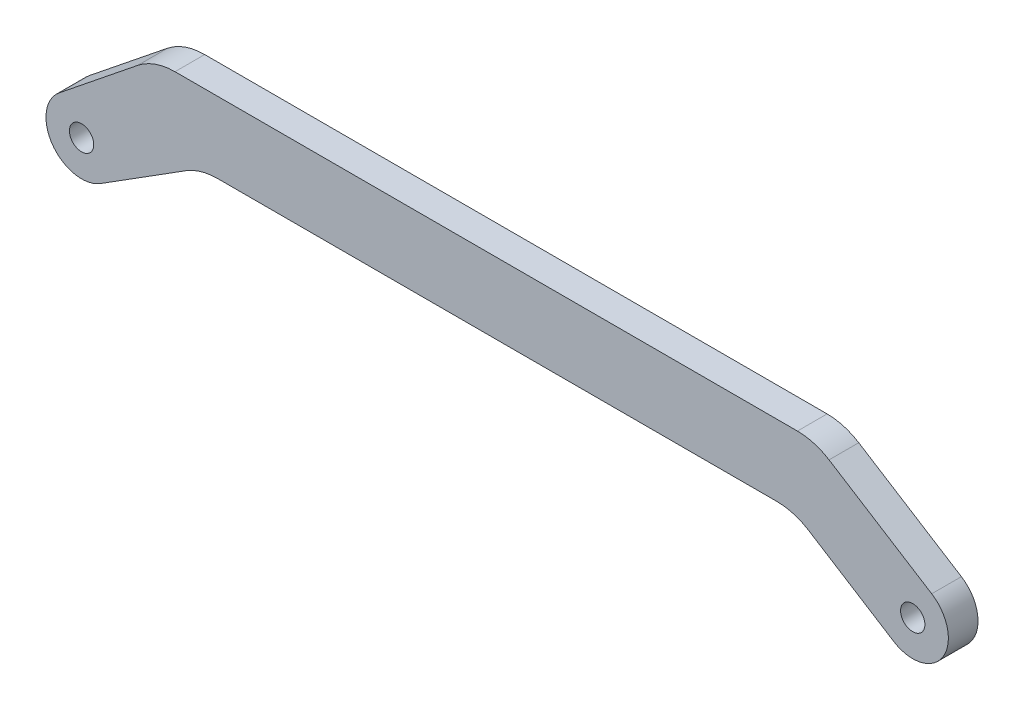
ISO-10303-21;
HEADER;
FILE_DESCRIPTION(('STEP AP214'),'2;1');
FILE_NAME('part.step','',(''),(''),'','','');
FILE_SCHEMA(('AUTOMOTIVE_DESIGN { 1 0 10303 214 1 1 1 1 }'));
ENDSEC;
DATA;
#1=APPLICATION_CONTEXT('core data for automotive mechanical design processes');
#2=APPLICATION_PROTOCOL_DEFINITION('international standard','automotive_design',2000,#1);
#3=PRODUCT_CONTEXT('',#1,'mechanical');
#4=PRODUCT('Part','Part','',(#3));
#5=PRODUCT_RELATED_PRODUCT_CATEGORY('part','',(#4));
#6=PRODUCT_DEFINITION_FORMATION('','',#4);
#7=PRODUCT_DEFINITION_CONTEXT('part definition',#1,'design');
#8=PRODUCT_DEFINITION('design','',#6,#7);
#9=PRODUCT_DEFINITION_SHAPE('','',#8);
#10=(LENGTH_UNIT() NAMED_UNIT(*) SI_UNIT(.MILLI.,.METRE.));
#11=(NAMED_UNIT(*) PLANE_ANGLE_UNIT() SI_UNIT($,.RADIAN.));
#12=(NAMED_UNIT(*) SI_UNIT($,.STERADIAN.) SOLID_ANGLE_UNIT());
#13=UNCERTAINTY_MEASURE_WITH_UNIT(LENGTH_MEASURE(1.E-05),#10,'distance_accuracy_value','');
#14=(GEOMETRIC_REPRESENTATION_CONTEXT(3) GLOBAL_UNCERTAINTY_ASSIGNED_CONTEXT((#13)) GLOBAL_UNIT_ASSIGNED_CONTEXT((#10,
#11,#12)) REPRESENTATION_CONTEXT('',''));
#15=CARTESIAN_POINT('',(0.,0.,0.));
#16=DIRECTION('',(0.,0.,1.));
#17=DIRECTION('',(1.,0.,0.));
#18=AXIS2_PLACEMENT_3D('',#15,#16,#17);
#19=CARTESIAN_POINT('',(15.7364952951131,7.50778352946216,5.));
#20=DIRECTION('',(0.,0.,-1.));
#21=DIRECTION('',(-1.,0.,0.));
#22=AXIS2_PLACEMENT_3D('',#19,#20,#21);
#23=CYLINDRICAL_SURFACE('',#22,10.);
#24=CARTESIAN_POINT('',(15.7364952951131,7.50778352946216,0.));
#25=DIRECTION('',(0.,0.,1.));
#26=DIRECTION('',(1.,0.,0.));
#27=AXIS2_PLACEMENT_3D('',#24,#25,#26);
#28=CIRCLE('',#27,10.);
#29=CARTESIAN_POINT('',(9.47479683384796,15.304650360452,0.));
#30=VERTEX_POINT('',#29);
#31=CARTESIAN_POINT('',(15.7364952951131,17.5077835294622,0.));
#32=VERTEX_POINT('',#31);
#33=EDGE_CURVE('E162',#30,#32,#28,.F.);
#34=ORIENTED_EDGE('',*,*,#33,.F.);
#35=DIRECTION('',(0.,0.,-1.));
#36=VECTOR('',#35,1.);
#37=CARTESIAN_POINT('',(9.47479683384796,15.304650360452,5.));
#38=LINE('',#37,#36);
#39=CARTESIAN_POINT('',(9.47479683384796,15.304650360452,5.));
#40=VERTEX_POINT('',#39);
#41=EDGE_CURVE('E11',#40,#30,#38,.T.);
#42=ORIENTED_EDGE('',*,*,#41,.F.);
#43=CARTESIAN_POINT('',(15.7364952951131,7.50778352946216,5.));
#44=DIRECTION('',(0.,0.,1.));
#45=DIRECTION('',(1.,0.,0.));
#46=AXIS2_PLACEMENT_3D('',#43,#44,#45);
#47=CIRCLE('',#46,10.);
#48=CARTESIAN_POINT('',(15.7364952951131,17.5077835294622,5.));
#49=VERTEX_POINT('',#48);
#50=EDGE_CURVE('E198',#40,#49,#47,.F.);
#51=ORIENTED_EDGE('',*,*,#50,.T.);
#52=DIRECTION('',(0.,0.,-1.));
#53=VECTOR('',#52,1.);
#54=CARTESIAN_POINT('',(15.7364952951131,17.5077835294622,5.));
#55=LINE('',#54,#53);
#56=EDGE_CURVE('E55',#49,#32,#55,.T.);
#57=ORIENTED_EDGE('',*,*,#56,.T.);
#58=EDGE_LOOP('',(#34,#42,#51,#57));
#59=FACE_BOUND('',#58,.T.);
#60=ADVANCED_FACE('F39',(#59),#23,.T.);
#61=CARTESIAN_POINT('',(-3.75701907675908,4.67812009859392,5.));
#62=DIRECTION('',(-0.626169846126513,0.779686683098986,0.));
#63=DIRECTION('',(-0.779686683098986,-0.626169846126513,0.));
#64=AXIS2_PLACEMENT_3D('',#61,#62,#63);
#65=PLANE('',#64);
#66=DIRECTION('',(0.779686683098986,0.626169846126513,0.));
#67=VECTOR('',#66,1.);
#68=CARTESIAN_POINT('',(-3.75701907675908,4.67812009859392,0.));
#69=LINE('',#68,#67);
#70=CARTESIAN_POINT('',(-3.75701907675908,4.67812009859392,0.));
#71=VERTEX_POINT('',#70);
#72=EDGE_CURVE('E164',#71,#30,#69,.T.);
#73=ORIENTED_EDGE('',*,*,#72,.F.);
#74=DIRECTION('',(0.,0.,-1.));
#75=VECTOR('',#74,1.);
#76=CARTESIAN_POINT('',(-3.75701907675908,4.67812009859392,5.));
#77=LINE('',#76,#75);
#78=CARTESIAN_POINT('',(-3.75701907675908,4.67812009859392,5.));
#79=VERTEX_POINT('',#78);
#80=EDGE_CURVE('E47',#79,#71,#77,.T.);
#81=ORIENTED_EDGE('',*,*,#80,.F.);
#82=DIRECTION('',(0.779686683098986,0.626169846126513,0.));
#83=VECTOR('',#82,1.);
#84=CARTESIAN_POINT('',(-3.75701907675908,4.67812009859392,5.));
#85=LINE('',#84,#83);
#86=EDGE_CURVE('E231',#79,#40,#85,.T.);
#87=ORIENTED_EDGE('',*,*,#86,.T.);
#88=ORIENTED_EDGE('',*,*,#41,.T.);
#89=EDGE_LOOP('',(#73,#81,#87,#88));
#90=FACE_BOUND('',#89,.T.);
#91=ADVANCED_FACE('F230',(#90),#65,.T.);
#92=CARTESIAN_POINT('',(0.,0.,5.));
#93=DIRECTION('',(0.,0.,-1.));
#94=DIRECTION('',(-1.,0.,0.));
#95=AXIS2_PLACEMENT_3D('',#92,#93,#94);
#96=CYLINDRICAL_SURFACE('',#95,6.);
#97=CARTESIAN_POINT('',(0.,0.,0.));
#98=DIRECTION('',(0.,0.,1.));
#99=DIRECTION('',(1.,0.,0.));
#100=AXIS2_PLACEMENT_3D('',#97,#98,#99);
#101=CIRCLE('',#100,6.);
#102=CARTESIAN_POINT('',(3.19805613686114,-5.07665607910215,0.));
#103=VERTEX_POINT('',#102);
#104=EDGE_CURVE('E167',#71,#103,#101,.T.);
#105=ORIENTED_EDGE('',*,*,#104,.T.);
#106=DIRECTION('',(0.,0.,-1.));
#107=VECTOR('',#106,1.);
#108=CARTESIAN_POINT('',(3.19805613686114,-5.07665607910215,5.));
#109=LINE('',#108,#107);
#110=CARTESIAN_POINT('',(3.19805613686114,-5.07665607910215,5.));
#111=VERTEX_POINT('',#110);
#112=EDGE_CURVE('E214',#111,#103,#109,.T.);
#113=ORIENTED_EDGE('',*,*,#112,.F.);
#114=CARTESIAN_POINT('',(0.,0.,5.));
#115=DIRECTION('',(0.,0.,1.));
#116=DIRECTION('',(1.,0.,0.));
#117=AXIS2_PLACEMENT_3D('',#114,#115,#116);
#118=CIRCLE('',#117,6.);
#119=EDGE_CURVE('E220',#79,#111,#118,.T.);
#120=ORIENTED_EDGE('',*,*,#119,.F.);
#121=ORIENTED_EDGE('',*,*,#80,.T.);
#122=EDGE_LOOP('',(#105,#113,#120,#121));
#123=FACE_BOUND('',#122,.T.);
#124=ADVANCED_FACE('F218',(#123),#96,.T.);
#125=CARTESIAN_POINT('',(3.19805613686114,-5.07665607910215,5.));
#126=DIRECTION('',(0.533009356143523,-0.846109346517025,0.));
#127=DIRECTION('',(0.846109346517025,0.533009356143523,0.));
#128=AXIS2_PLACEMENT_3D('',#125,#126,#127);
#129=PLANE('',#128);
#130=DIRECTION('',(-0.846109346517025,-0.533009356143523,0.));
#131=VECTOR('',#130,1.);
#132=CARTESIAN_POINT('',(3.19805613686114,-5.07665607910215,0.));
#133=LINE('',#132,#131);
#134=CARTESIAN_POINT('',(17.5571100440778,3.96887699463241,0.));
#135=VERTEX_POINT('',#134);
#136=EDGE_CURVE('E170',#135,#103,#133,.T.);
#137=ORIENTED_EDGE('',*,*,#136,.F.);
#138=DIRECTION('',(0.,0.,-1.));
#139=VECTOR('',#138,1.);
#140=CARTESIAN_POINT('',(17.5571100440778,3.96887699463241,5.));
#141=LINE('',#140,#139);
#142=CARTESIAN_POINT('',(17.5571100440778,3.96887699463241,5.));
#143=VERTEX_POINT('',#142);
#144=EDGE_CURVE('E212',#143,#135,#141,.T.);
#145=ORIENTED_EDGE('',*,*,#144,.F.);
#146=DIRECTION('',(-0.846109346517025,-0.533009356143523,0.));
#147=VECTOR('',#146,1.);
#148=CARTESIAN_POINT('',(3.19805613686114,-5.07665607910215,5.));
#149=LINE('',#148,#147);
#150=EDGE_CURVE('E422',#143,#111,#149,.T.);
#151=ORIENTED_EDGE('',*,*,#150,.T.);
#152=ORIENTED_EDGE('',*,*,#112,.T.);
#153=EDGE_LOOP('',(#137,#145,#151,#152));
#154=FACE_BOUND('',#153,.T.);
#155=ADVANCED_FACE('F253',(#154),#129,.T.);
#156=CARTESIAN_POINT('',(22.887203605513,-4.49221647053784,5.));
#157=DIRECTION('',(0.,0.,-1.));
#158=DIRECTION('',(-1.,0.,0.));
#159=AXIS2_PLACEMENT_3D('',#156,#157,#158);
#160=CYLINDRICAL_SURFACE('',#159,10.);
#161=CARTESIAN_POINT('',(22.887203605513,-4.49221647053784,0.));
#162=DIRECTION('',(0.,0.,1.));
#163=DIRECTION('',(1.,0.,0.));
#164=AXIS2_PLACEMENT_3D('',#161,#162,#163);
#165=CIRCLE('',#164,10.);
#166=CARTESIAN_POINT('',(22.887203605513,5.50778352946216,0.));
#167=VERTEX_POINT('',#166);
#168=EDGE_CURVE('E173',#135,#167,#165,.F.);
#169=ORIENTED_EDGE('',*,*,#168,.T.);
#170=DIRECTION('',(0.,0.,-1.));
#171=VECTOR('',#170,1.);
#172=CARTESIAN_POINT('',(22.887203605513,5.50778352946216,5.));
#173=LINE('',#172,#171);
#174=CARTESIAN_POINT('',(22.887203605513,5.50778352946216,5.));
#175=VERTEX_POINT('',#174);
#176=EDGE_CURVE('E209',#175,#167,#173,.T.);
#177=ORIENTED_EDGE('',*,*,#176,.F.);
#178=CARTESIAN_POINT('',(22.887203605513,-4.49221647053784,5.));
#179=DIRECTION('',(0.,0.,1.));
#180=DIRECTION('',(1.,0.,0.));
#181=AXIS2_PLACEMENT_3D('',#178,#179,#180);
#182=CIRCLE('',#181,10.);
#183=EDGE_CURVE('E423',#143,#175,#182,.F.);
#184=ORIENTED_EDGE('',*,*,#183,.F.);
#185=ORIENTED_EDGE('',*,*,#144,.T.);
#186=EDGE_LOOP('',(#169,#177,#184,#185));
#187=FACE_BOUND('',#186,.T.);
#188=ADVANCED_FACE('F258',(#187),#160,.F.);
#189=CARTESIAN_POINT('',(0.,5.50778352946216,5.));
#190=DIRECTION('',(0.,1.,0.));
#191=DIRECTION('',(-1.,0.,0.));
#192=AXIS2_PLACEMENT_3D('',#189,#190,#191);
#193=PLANE('',#192);
#194=DIRECTION('',(1.,0.,0.));
#195=VECTOR('',#194,1.);
#196=CARTESIAN_POINT('',(0.,5.50778352946216,0.));
#197=LINE('',#196,#195);
#198=CARTESIAN_POINT('',(117.112796394487,5.50778352946216,0.));
#199=VERTEX_POINT('',#198);
#200=EDGE_CURVE('E175',#167,#199,#197,.T.);
#201=ORIENTED_EDGE('',*,*,#200,.T.);
#202=DIRECTION('',(0.,0.,-1.));
#203=VECTOR('',#202,1.);
#204=CARTESIAN_POINT('',(117.112796394487,5.50778352946216,5.));
#205=LINE('',#204,#203);
#206=CARTESIAN_POINT('',(117.112796394487,5.50778352946216,5.));
#207=VERTEX_POINT('',#206);
#208=EDGE_CURVE('E207',#207,#199,#205,.T.);
#209=ORIENTED_EDGE('',*,*,#208,.F.);
#210=DIRECTION('',(1.,0.,0.));
#211=VECTOR('',#210,1.);
#212=CARTESIAN_POINT('',(0.,5.50778352946216,5.));
#213=LINE('',#212,#211);
#214=EDGE_CURVE('E425',#175,#207,#213,.T.);
#215=ORIENTED_EDGE('',*,*,#214,.F.);
#216=ORIENTED_EDGE('',*,*,#176,.T.);
#217=EDGE_LOOP('',(#201,#209,#215,#216));
#218=FACE_BOUND('',#217,.T.);
#219=ADVANCED_FACE('F262',(#218),#193,.F.);
#220=CARTESIAN_POINT('',(117.112796394487,-4.49221647053784,5.));
#221=DIRECTION('',(0.,0.,-1.));
#222=DIRECTION('',(-1.,0.,0.));
#223=AXIS2_PLACEMENT_3D('',#220,#221,#222);
#224=CYLINDRICAL_SURFACE('',#223,10.);
#225=CARTESIAN_POINT('',(117.112796394487,-4.49221647053784,0.));
#226=DIRECTION('',(0.,0.,1.));
#227=DIRECTION('',(1.,0.,0.));
#228=AXIS2_PLACEMENT_3D('',#225,#226,#227);
#229=CIRCLE('',#228,10.);
#230=CARTESIAN_POINT('',(122.442889955922,3.96887699463241,0.));
#231=VERTEX_POINT('',#230);
#232=EDGE_CURVE('E178',#231,#199,#229,.T.);
#233=ORIENTED_EDGE('',*,*,#232,.F.);
#234=DIRECTION('',(0.,0.,-1.));
#235=VECTOR('',#234,1.);
#236=CARTESIAN_POINT('',(122.442889955922,3.96887699463241,5.));
#237=LINE('',#236,#235);
#238=CARTESIAN_POINT('',(122.442889955922,3.96887699463241,5.));
#239=VERTEX_POINT('',#238);
#240=EDGE_CURVE('E205',#239,#231,#237,.T.);
#241=ORIENTED_EDGE('',*,*,#240,.F.);
#242=CARTESIAN_POINT('',(117.112796394487,-4.49221647053784,5.));
#243=DIRECTION('',(0.,0.,1.));
#244=DIRECTION('',(1.,0.,0.));
#245=AXIS2_PLACEMENT_3D('',#242,#243,#244);
#246=CIRCLE('',#245,10.);
#247=EDGE_CURVE('E416',#239,#207,#246,.T.);
#248=ORIENTED_EDGE('',*,*,#247,.T.);
#249=ORIENTED_EDGE('',*,*,#208,.T.);
#250=EDGE_LOOP('',(#233,#241,#248,#249));
#251=FACE_BOUND('',#250,.T.);
#252=ADVANCED_FACE('F266',(#251),#224,.F.);
#253=CARTESIAN_POINT('',(36.5758001862535,58.0611316428658,5.));
#254=DIRECTION('',(0.533009356143523,0.846109346517025,0.));
#255=DIRECTION('',(-0.846109346517025,0.533009356143524,0.));
#256=AXIS2_PLACEMENT_3D('',#253,#254,#255);
#257=PLANE('',#256);
#258=DIRECTION('',(0.846109346517025,-0.533009356143524,0.));
#259=VECTOR('',#258,1.);
#260=CARTESIAN_POINT('',(36.5758001862535,58.0611316428658,0.));
#261=LINE('',#260,#259);
#262=CARTESIAN_POINT('',(136.801943863139,-5.07665607910217,0.));
#263=VERTEX_POINT('',#262);
#264=EDGE_CURVE('E181',#231,#263,#261,.T.);
#265=ORIENTED_EDGE('',*,*,#264,.T.);
#266=DIRECTION('',(0.,0.,-1.));
#267=VECTOR('',#266,1.);
#268=CARTESIAN_POINT('',(136.801943863139,-5.07665607910217,5.));
#269=LINE('',#268,#267);
#270=CARTESIAN_POINT('',(136.801943863139,-5.07665607910217,5.));
#271=VERTEX_POINT('',#270);
#272=EDGE_CURVE('E202',#271,#263,#269,.T.);
#273=ORIENTED_EDGE('',*,*,#272,.F.);
#274=DIRECTION('',(0.846109346517025,-0.533009356143524,0.));
#275=VECTOR('',#274,1.);
#276=CARTESIAN_POINT('',(36.5758001862535,58.0611316428658,5.));
#277=LINE('',#276,#275);
#278=EDGE_CURVE('E432',#239,#271,#277,.T.);
#279=ORIENTED_EDGE('',*,*,#278,.F.);
#280=ORIENTED_EDGE('',*,*,#240,.T.);
#281=EDGE_LOOP('',(#265,#273,#279,#280));
#282=FACE_BOUND('',#281,.T.);
#283=ADVANCED_FACE('F270',(#282),#257,.F.);
#284=CARTESIAN_POINT('',(140.,0.,5.));
#285=DIRECTION('',(0.,0.,-1.));
#286=DIRECTION('',(-1.,0.,0.));
#287=AXIS2_PLACEMENT_3D('',#284,#285,#286);
#288=CYLINDRICAL_SURFACE('',#287,6.);
#289=CARTESIAN_POINT('',(140.,0.,0.));
#290=DIRECTION('',(0.,0.,1.));
#291=DIRECTION('',(1.,0.,0.));
#292=AXIS2_PLACEMENT_3D('',#289,#290,#291);
#293=CIRCLE('',#292,6.);
#294=CARTESIAN_POINT('',(143.198056136861,5.07665607910213,0.));
#295=VERTEX_POINT('',#294);
#296=EDGE_CURVE('E183',#263,#295,#293,.T.);
#297=ORIENTED_EDGE('',*,*,#296,.T.);
#298=DIRECTION('',(0.,0.,-1.));
#299=VECTOR('',#298,1.);
#300=CARTESIAN_POINT('',(143.198056136861,5.07665607910213,5.));
#301=LINE('',#300,#299);
#302=CARTESIAN_POINT('',(143.198056136861,5.07665607910213,5.));
#303=VERTEX_POINT('',#302);
#304=EDGE_CURVE('E138',#303,#295,#301,.T.);
#305=ORIENTED_EDGE('',*,*,#304,.F.);
#306=CARTESIAN_POINT('',(140.,0.,5.));
#307=DIRECTION('',(0.,0.,1.));
#308=DIRECTION('',(1.,0.,0.));
#309=AXIS2_PLACEMENT_3D('',#306,#307,#308);
#310=CIRCLE('',#309,6.);
#311=EDGE_CURVE('E147',#271,#303,#310,.T.);
#312=ORIENTED_EDGE('',*,*,#311,.F.);
#313=ORIENTED_EDGE('',*,*,#272,.T.);
#314=EDGE_LOOP('',(#297,#305,#312,#313));
#315=FACE_BOUND('',#314,.T.);
#316=ADVANCED_FACE('F274',(#315),#288,.T.);
#317=CARTESIAN_POINT('',(42.9719124599757,68.21444380107,5.));
#318=DIRECTION('',(0.533009356143523,0.846109346517025,0.));
#319=DIRECTION('',(-0.846109346517025,0.533009356143523,0.));
#320=AXIS2_PLACEMENT_3D('',#317,#318,#319);
#321=PLANE('',#320);
#322=DIRECTION('',(0.846109346517025,-0.533009356143523,0.));
#323=VECTOR('',#322,1.);
#324=CARTESIAN_POINT('',(42.9719124599757,68.21444380107,0.));
#325=LINE('',#324,#323);
#326=CARTESIAN_POINT('',(125.907534282538,15.9688769946324,0.));
#327=VERTEX_POINT('',#326);
#328=EDGE_CURVE('E134',#327,#295,#325,.T.);
#329=ORIENTED_EDGE('',*,*,#328,.F.);
#330=DIRECTION('',(0.,0.,-1.));
#331=VECTOR('',#330,1.);
#332=CARTESIAN_POINT('',(125.907534282538,15.9688769946324,5.));
#333=LINE('',#332,#331);
#334=CARTESIAN_POINT('',(125.907534282538,15.9688769946324,5.));
#335=VERTEX_POINT('',#334);
#336=EDGE_CURVE('E129',#335,#327,#333,.T.);
#337=ORIENTED_EDGE('',*,*,#336,.F.);
#338=DIRECTION('',(0.846109346517025,-0.533009356143523,0.));
#339=VECTOR('',#338,1.);
#340=CARTESIAN_POINT('',(42.9719124599757,68.21444380107,5.));
#341=LINE('',#340,#339);
#342=EDGE_CURVE('E132',#335,#303,#341,.T.);
#343=ORIENTED_EDGE('',*,*,#342,.T.);
#344=ORIENTED_EDGE('',*,*,#304,.T.);
#345=EDGE_LOOP('',(#329,#337,#343,#344));
#346=FACE_BOUND('',#345,.T.);
#347=ADVANCED_FACE('F131',(#346),#321,.T.);
#348=CARTESIAN_POINT('',(120.577440721103,7.50778352946216,5.));
#349=DIRECTION('',(0.,0.,-1.));
#350=DIRECTION('',(-1.,0.,0.));
#351=AXIS2_PLACEMENT_3D('',#348,#349,#350);
#352=CYLINDRICAL_SURFACE('',#351,9.99999999999999);
#353=CARTESIAN_POINT('',(120.577440721103,7.50778352946216,0.));
#354=DIRECTION('',(0.,0.,1.));
#355=DIRECTION('',(1.,0.,0.));
#356=AXIS2_PLACEMENT_3D('',#353,#354,#355);
#357=CIRCLE('',#356,9.99999999999999);
#358=CARTESIAN_POINT('',(120.577440721103,17.5077835294622,0.));
#359=VERTEX_POINT('',#358);
#360=EDGE_CURVE('E187',#359,#327,#357,.F.);
#361=ORIENTED_EDGE('',*,*,#360,.F.);
#362=DIRECTION('',(0.,0.,-1.));
#363=VECTOR('',#362,1.);
#364=CARTESIAN_POINT('',(120.577440721103,17.5077835294622,5.));
#365=LINE('',#364,#363);
#366=CARTESIAN_POINT('',(120.577440721103,17.5077835294622,5.));
#367=VERTEX_POINT('',#366);
#368=EDGE_CURVE('E92',#367,#359,#365,.T.);
#369=ORIENTED_EDGE('',*,*,#368,.F.);
#370=CARTESIAN_POINT('',(120.577440721103,7.50778352946216,5.));
#371=DIRECTION('',(0.,0.,1.));
#372=DIRECTION('',(1.,0.,0.));
#373=AXIS2_PLACEMENT_3D('',#370,#371,#372);
#374=CIRCLE('',#373,9.99999999999999);
#375=EDGE_CURVE('E145',#367,#335,#374,.F.);
#376=ORIENTED_EDGE('',*,*,#375,.T.);
#377=ORIENTED_EDGE('',*,*,#336,.T.);
#378=EDGE_LOOP('',(#361,#369,#376,#377));
#379=FACE_BOUND('',#378,.T.);
#380=ADVANCED_FACE('F150',(#379),#352,.T.);
#381=CARTESIAN_POINT('',(140.,0.,5.));
#382=DIRECTION('',(0.,0.,-1.));
#383=DIRECTION('',(-1.,0.,0.));
#384=AXIS2_PLACEMENT_3D('',#381,#382,#383);
#385=CYLINDRICAL_SURFACE('',#384,2.04999999999999);
#386=CARTESIAN_POINT('',(140.,0.,5.));
#387=DIRECTION('',(0.,0.,1.));
#388=DIRECTION('',(1.,0.,0.));
#389=AXIS2_PLACEMENT_3D('',#386,#387,#388);
#390=CIRCLE('',#389,2.04999999999999);
#391=CARTESIAN_POINT('',(142.05,0.,5.));
#392=VERTEX_POINT('',#391);
#393=EDGE_CURVE('E153',#392,#392,#390,.T.);
#394=ORIENTED_EDGE('',*,*,#393,.T.);
#395=EDGE_LOOP('',(#394));
#396=FACE_BOUND('',#395,.T.);
#397=CARTESIAN_POINT('',(140.,0.,0.));
#398=DIRECTION('',(0.,0.,1.));
#399=DIRECTION('',(1.,0.,0.));
#400=AXIS2_PLACEMENT_3D('',#397,#398,#399);
#401=CIRCLE('',#400,2.04999999999999);
#402=CARTESIAN_POINT('',(142.05,0.,0.));
#403=VERTEX_POINT('',#402);
#404=EDGE_CURVE('E192',#403,#403,#401,.T.);
#405=ORIENTED_EDGE('',*,*,#404,.F.);
#406=EDGE_LOOP('',(#405));
#407=FACE_BOUND('',#406,.T.);
#408=ADVANCED_FACE('F235',(#396,#407),#385,.F.);
#409=CARTESIAN_POINT('',(0.,17.5077835294622,5.));
#410=DIRECTION('',(0.,1.,0.));
#411=DIRECTION('',(-1.,0.,0.));
#412=AXIS2_PLACEMENT_3D('',#409,#410,#411);
#413=PLANE('',#412);
#414=DIRECTION('',(1.,0.,0.));
#415=VECTOR('',#414,1.);
#416=CARTESIAN_POINT('',(0.,17.5077835294622,0.));
#417=LINE('',#416,#415);
#418=EDGE_CURVE('E189',#32,#359,#417,.T.);
#419=ORIENTED_EDGE('',*,*,#418,.F.);
#420=ORIENTED_EDGE('',*,*,#56,.F.);
#421=DIRECTION('',(1.,0.,0.));
#422=VECTOR('',#421,1.);
#423=CARTESIAN_POINT('',(0.,17.5077835294622,5.));
#424=LINE('',#423,#422);
#425=EDGE_CURVE('E151',#49,#367,#424,.T.);
#426=ORIENTED_EDGE('',*,*,#425,.T.);
#427=ORIENTED_EDGE('',*,*,#368,.T.);
#428=EDGE_LOOP('',(#419,#420,#426,#427));
#429=FACE_BOUND('',#428,.T.);
#430=ADVANCED_FACE('F232',(#429),#413,.T.);
#431=CARTESIAN_POINT('',(0.,0.,5.));
#432=DIRECTION('',(0.,0.,-1.));
#433=DIRECTION('',(-1.,0.,0.));
#434=AXIS2_PLACEMENT_3D('',#431,#432,#433);
#435=CYLINDRICAL_SURFACE('',#434,2.05);
#436=CARTESIAN_POINT('',(0.,0.,5.));
#437=DIRECTION('',(0.,0.,1.));
#438=DIRECTION('',(1.,0.,0.));
#439=AXIS2_PLACEMENT_3D('',#436,#437,#438);
#440=CIRCLE('',#439,2.05);
#441=CARTESIAN_POINT('',(2.05,0.,5.));
#442=VERTEX_POINT('',#441);
#443=EDGE_CURVE('E159',#442,#442,#440,.T.);
#444=ORIENTED_EDGE('',*,*,#443,.T.);
#445=EDGE_LOOP('',(#444));
#446=FACE_BOUND('',#445,.T.);
#447=CARTESIAN_POINT('',(0.,0.,0.));
#448=DIRECTION('',(0.,0.,1.));
#449=DIRECTION('',(1.,0.,0.));
#450=AXIS2_PLACEMENT_3D('',#447,#448,#449);
#451=CIRCLE('',#450,2.05);
#452=CARTESIAN_POINT('',(2.05,0.,0.));
#453=VERTEX_POINT('',#452);
#454=EDGE_CURVE('E195',#453,#453,#451,.T.);
#455=ORIENTED_EDGE('',*,*,#454,.F.);
#456=EDGE_LOOP('',(#455));
#457=FACE_BOUND('',#456,.T.);
#458=ADVANCED_FACE('F234',(#446,#457),#435,.F.);
#459=CARTESIAN_POINT('',(0.,0.,5.));
#460=DIRECTION('',(0.,0.,1.));
#461=DIRECTION('',(1.,0.,0.));
#462=AXIS2_PLACEMENT_3D('',#459,#460,#461);
#463=PLANE('',#462);
#464=ORIENTED_EDGE('',*,*,#50,.F.);
#465=ORIENTED_EDGE('',*,*,#86,.F.);
#466=ORIENTED_EDGE('',*,*,#119,.T.);
#467=ORIENTED_EDGE('',*,*,#150,.F.);
#468=ORIENTED_EDGE('',*,*,#183,.T.);
#469=ORIENTED_EDGE('',*,*,#214,.T.);
#470=ORIENTED_EDGE('',*,*,#247,.F.);
#471=ORIENTED_EDGE('',*,*,#278,.T.);
#472=ORIENTED_EDGE('',*,*,#311,.T.);
#473=ORIENTED_EDGE('',*,*,#342,.F.);
#474=ORIENTED_EDGE('',*,*,#375,.F.);
#475=ORIENTED_EDGE('',*,*,#425,.F.);
#476=EDGE_LOOP('',(#464,#465,#466,#467,#468,#469,#470,#471,#472,#473,#474,#475));
#477=FACE_BOUND('',#476,.T.);
#478=ORIENTED_EDGE('',*,*,#393,.F.);
#479=EDGE_LOOP('',(#478));
#480=FACE_BOUND('',#479,.T.);
#481=ORIENTED_EDGE('',*,*,#443,.F.);
#482=EDGE_LOOP('',(#481));
#483=FACE_BOUND('',#482,.T.);
#484=ADVANCED_FACE('F142',(#477,#480,#483),#463,.T.);
#485=CARTESIAN_POINT('',(0.,0.,0.));
#486=DIRECTION('',(0.,0.,1.));
#487=DIRECTION('',(1.,0.,0.));
#488=AXIS2_PLACEMENT_3D('',#485,#486,#487);
#489=PLANE('',#488);
#490=ORIENTED_EDGE('',*,*,#33,.T.);
#491=ORIENTED_EDGE('',*,*,#418,.T.);
#492=ORIENTED_EDGE('',*,*,#360,.T.);
#493=ORIENTED_EDGE('',*,*,#328,.T.);
#494=ORIENTED_EDGE('',*,*,#296,.F.);
#495=ORIENTED_EDGE('',*,*,#264,.F.);
#496=ORIENTED_EDGE('',*,*,#232,.T.);
#497=ORIENTED_EDGE('',*,*,#200,.F.);
#498=ORIENTED_EDGE('',*,*,#168,.F.);
#499=ORIENTED_EDGE('',*,*,#136,.T.);
#500=ORIENTED_EDGE('',*,*,#104,.F.);
#501=ORIENTED_EDGE('',*,*,#72,.T.);
#502=EDGE_LOOP('',(#490,#491,#492,#493,#494,#495,#496,#497,#498,#499,#500,#501));
#503=FACE_BOUND('',#502,.T.);
#504=ORIENTED_EDGE('',*,*,#404,.T.);
#505=EDGE_LOOP('',(#504));
#506=FACE_BOUND('',#505,.T.);
#507=ORIENTED_EDGE('',*,*,#454,.T.);
#508=EDGE_LOOP('',(#507));
#509=FACE_BOUND('',#508,.T.);
#510=ADVANCED_FACE('F226',(#503,#506,#509),#489,.F.);
#511=CLOSED_SHELL('',(#60,#91,#124,#155,#188,#219,#252,#283,#316,#347,#380,#408,#430,#458,#484,#510));
#512=MANIFOLD_SOLID_BREP('B2',#511);
#513=ADVANCED_BREP_SHAPE_REPRESENTATION('',(#18,#512),#14);
#514=SHAPE_DEFINITION_REPRESENTATION(#9,#513);
ENDSEC;
END-ISO-10303-21;
